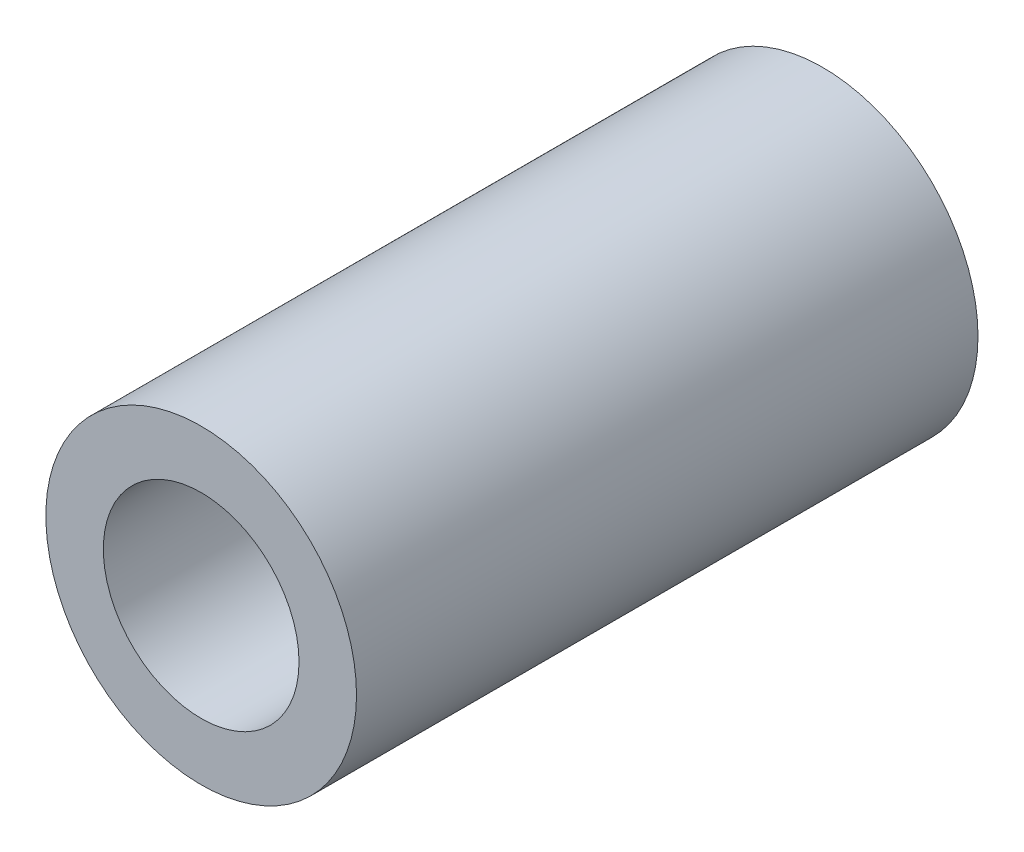
ISO-10303-21;
HEADER;
FILE_DESCRIPTION(('STEP AP214'),'2;1');
FILE_NAME('part.step','',(''),(''),'','','');
FILE_SCHEMA(('AUTOMOTIVE_DESIGN { 1 0 10303 214 1 1 1 1 }'));
ENDSEC;
DATA;
#1=APPLICATION_CONTEXT('core data for automotive mechanical design processes');
#2=APPLICATION_PROTOCOL_DEFINITION('international standard','automotive_design',2000,#1);
#3=PRODUCT_CONTEXT('',#1,'mechanical');
#4=PRODUCT('Part','Part','',(#3));
#5=PRODUCT_RELATED_PRODUCT_CATEGORY('part','',(#4));
#6=PRODUCT_DEFINITION_FORMATION('','',#4);
#7=PRODUCT_DEFINITION_CONTEXT('part definition',#1,'design');
#8=PRODUCT_DEFINITION('design','',#6,#7);
#9=PRODUCT_DEFINITION_SHAPE('','',#8);
#10=(LENGTH_UNIT() NAMED_UNIT(*) SI_UNIT(.MILLI.,.METRE.));
#11=(NAMED_UNIT(*) PLANE_ANGLE_UNIT() SI_UNIT($,.RADIAN.));
#12=(NAMED_UNIT(*) SI_UNIT($,.STERADIAN.) SOLID_ANGLE_UNIT());
#13=UNCERTAINTY_MEASURE_WITH_UNIT(LENGTH_MEASURE(1.E-05),#10,'distance_accuracy_value','');
#14=(GEOMETRIC_REPRESENTATION_CONTEXT(3) GLOBAL_UNCERTAINTY_ASSIGNED_CONTEXT((#13)) GLOBAL_UNIT_ASSIGNED_CONTEXT((#10,
#11,#12)) REPRESENTATION_CONTEXT('',''));
#15=CARTESIAN_POINT('',(0.,0.,0.));
#16=DIRECTION('',(0.,0.,1.));
#17=DIRECTION('',(1.,0.,0.));
#18=AXIS2_PLACEMENT_3D('',#15,#16,#17);
#19=CARTESIAN_POINT('',(0.,0.,4.763750061));
#20=DIRECTION('',(0.,0.,1.));
#21=DIRECTION('',(1.,0.,0.));
#22=AXIS2_PLACEMENT_3D('',#19,#20,#21);
#23=PLANE('',#22);
#24=CARTESIAN_POINT('',(0.,0.,4.763750061));
#25=DIRECTION('',(0.,0.,1.));
#26=DIRECTION('',(1.,0.,0.));
#27=AXIS2_PLACEMENT_3D('',#24,#25,#26);
#28=CIRCLE('',#27,2.38125);
#29=CARTESIAN_POINT('',(2.38125,0.,4.763750061));
#30=VERTEX_POINT('',#29);
#31=EDGE_CURVE('E10',#30,#30,#28,.T.);
#32=ORIENTED_EDGE('',*,*,#31,.T.);
#33=EDGE_LOOP('',(#32));
#34=FACE_BOUND('',#33,.T.);
#35=CARTESIAN_POINT('',(0.,0.,4.763750061));
#36=DIRECTION('',(0.,0.,1.));
#37=DIRECTION('',(1.,0.,0.));
#38=AXIS2_PLACEMENT_3D('',#35,#36,#37);
#39=CIRCLE('',#38,1.5);
#40=CARTESIAN_POINT('',(1.5,0.,4.763750061));
#41=VERTEX_POINT('',#40);
#42=EDGE_CURVE('E43',#41,#41,#39,.T.);
#43=ORIENTED_EDGE('',*,*,#42,.F.);
#44=EDGE_LOOP('',(#43));
#45=FACE_BOUND('',#44,.T.);
#46=ADVANCED_FACE('F32',(#34,#45),#23,.T.);
#47=CARTESIAN_POINT('',(0.,0.,-4.763750061));
#48=DIRECTION('',(0.,0.,1.));
#49=DIRECTION('',(1.,0.,0.));
#50=AXIS2_PLACEMENT_3D('',#47,#48,#49);
#51=PLANE('',#50);
#52=CARTESIAN_POINT('',(0.,0.,-4.763750061));
#53=DIRECTION('',(0.,0.,1.));
#54=DIRECTION('',(1.,0.,0.));
#55=AXIS2_PLACEMENT_3D('',#52,#53,#54);
#56=CIRCLE('',#55,2.38125);
#57=CARTESIAN_POINT('',(2.38125,0.,-4.763750061));
#58=VERTEX_POINT('',#57);
#59=EDGE_CURVE('E36',#58,#58,#56,.T.);
#60=ORIENTED_EDGE('',*,*,#59,.F.);
#61=EDGE_LOOP('',(#60));
#62=FACE_BOUND('',#61,.T.);
#63=CARTESIAN_POINT('',(0.,0.,-4.763750061));
#64=DIRECTION('',(0.,0.,1.));
#65=DIRECTION('',(1.,0.,0.));
#66=AXIS2_PLACEMENT_3D('',#63,#64,#65);
#67=CIRCLE('',#66,1.5);
#68=CARTESIAN_POINT('',(1.5,0.,-4.763750061));
#69=VERTEX_POINT('',#68);
#70=EDGE_CURVE('E45',#69,#69,#67,.T.);
#71=ORIENTED_EDGE('',*,*,#70,.T.);
#72=EDGE_LOOP('',(#71));
#73=FACE_BOUND('',#72,.T.);
#74=ADVANCED_FACE('F55',(#62,#73),#51,.F.);
#75=CARTESIAN_POINT('',(0.,0.,4.763750061));
#76=DIRECTION('',(0.,0.,-1.));
#77=DIRECTION('',(-1.,0.,0.));
#78=AXIS2_PLACEMENT_3D('',#75,#76,#77);
#79=CYLINDRICAL_SURFACE('',#78,2.38125);
#80=ORIENTED_EDGE('',*,*,#31,.F.);
#81=EDGE_LOOP('',(#80));
#82=FACE_BOUND('',#81,.T.);
#83=ORIENTED_EDGE('',*,*,#59,.T.);
#84=EDGE_LOOP('',(#83));
#85=FACE_BOUND('',#84,.T.);
#86=ADVANCED_FACE('F34',(#82,#85),#79,.T.);
#87=CARTESIAN_POINT('',(0.,0.,4.763750061));
#88=DIRECTION('',(0.,0.,-1.));
#89=DIRECTION('',(-1.,0.,0.));
#90=AXIS2_PLACEMENT_3D('',#87,#88,#89);
#91=CYLINDRICAL_SURFACE('',#90,1.5);
#92=ORIENTED_EDGE('',*,*,#42,.T.);
#93=EDGE_LOOP('',(#92));
#94=FACE_BOUND('',#93,.T.);
#95=ORIENTED_EDGE('',*,*,#70,.F.);
#96=EDGE_LOOP('',(#95));
#97=FACE_BOUND('',#96,.T.);
#98=ADVANCED_FACE('F51',(#94,#97),#91,.F.);
#99=CLOSED_SHELL('',(#46,#74,#86,#98));
#100=MANIFOLD_SOLID_BREP('B2',#99);
#101=ADVANCED_BREP_SHAPE_REPRESENTATION('',(#18,#100),#14);
#102=SHAPE_DEFINITION_REPRESENTATION(#9,#101);
ENDSEC;
END-ISO-10303-21;
